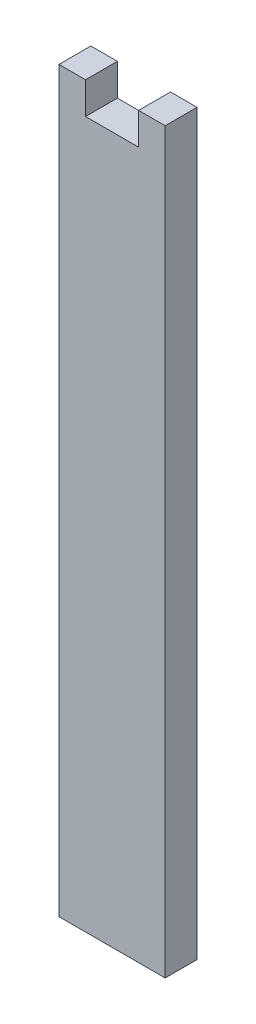
ISO-10303-21;
HEADER;
FILE_DESCRIPTION(('STEP AP214'),'2;1');
FILE_NAME('part.step','',(''),(''),'','','');
FILE_SCHEMA(('AUTOMOTIVE_DESIGN { 1 0 10303 214 1 1 1 1 }'));
ENDSEC;
DATA;
#1=APPLICATION_CONTEXT('core data for automotive mechanical design processes');
#2=APPLICATION_PROTOCOL_DEFINITION('international standard','automotive_design',2000,#1);
#3=PRODUCT_CONTEXT('',#1,'mechanical');
#4=PRODUCT('Part','Part','',(#3));
#5=PRODUCT_RELATED_PRODUCT_CATEGORY('part','',(#4));
#6=PRODUCT_DEFINITION_FORMATION('','',#4);
#7=PRODUCT_DEFINITION_CONTEXT('part definition',#1,'design');
#8=PRODUCT_DEFINITION('design','',#6,#7);
#9=PRODUCT_DEFINITION_SHAPE('','',#8);
#10=(LENGTH_UNIT() NAMED_UNIT(*) SI_UNIT(.MILLI.,.METRE.));
#11=(NAMED_UNIT(*) PLANE_ANGLE_UNIT() SI_UNIT($,.RADIAN.));
#12=(NAMED_UNIT(*) SI_UNIT($,.STERADIAN.) SOLID_ANGLE_UNIT());
#13=UNCERTAINTY_MEASURE_WITH_UNIT(LENGTH_MEASURE(1.E-05),#10,'distance_accuracy_value','');
#14=(GEOMETRIC_REPRESENTATION_CONTEXT(3) GLOBAL_UNCERTAINTY_ASSIGNED_CONTEXT((#13)) GLOBAL_UNIT_ASSIGNED_CONTEXT((#10,
#11,#12)) REPRESENTATION_CONTEXT('',''));
#15=CARTESIAN_POINT('',(0.,0.,0.));
#16=DIRECTION('',(0.,0.,1.));
#17=DIRECTION('',(1.,0.,0.));
#18=AXIS2_PLACEMENT_3D('',#15,#16,#17);
#19=CARTESIAN_POINT('',(0.,63.5,-6.));
#20=DIRECTION('',(0.,-1.,0.));
#21=DIRECTION('',(0.,0.,-1.));
#22=AXIS2_PLACEMENT_3D('',#19,#20,#21);
#23=PLANE('',#22);
#24=DIRECTION('',(1.,0.,0.));
#25=VECTOR('',#24,1.);
#26=CARTESIAN_POINT('',(0.,63.5,0.));
#27=LINE('',#26,#25);
#28=CARTESIAN_POINT('',(-5.,63.5,0.));
#29=VERTEX_POINT('',#28);
#30=CARTESIAN_POINT('',(5.,63.5,0.));
#31=VERTEX_POINT('',#30);
#32=EDGE_CURVE('E137',#29,#31,#27,.T.);
#33=ORIENTED_EDGE('',*,*,#32,.T.);
#34=DIRECTION('',(0.,0.,1.));
#35=VECTOR('',#34,1.);
#36=CARTESIAN_POINT('',(5.,63.5,-6.));
#37=LINE('',#36,#35);
#38=CARTESIAN_POINT('',(5.,63.5,-6.));
#39=VERTEX_POINT('',#38);
#40=EDGE_CURVE('E11',#39,#31,#37,.T.);
#41=ORIENTED_EDGE('',*,*,#40,.F.);
#42=DIRECTION('',(1.,0.,0.));
#43=VECTOR('',#42,1.);
#44=CARTESIAN_POINT('',(0.,63.5,-6.));
#45=LINE('',#44,#43);
#46=CARTESIAN_POINT('',(-5.,63.5,-6.));
#47=VERTEX_POINT('',#46);
#48=EDGE_CURVE('E59',#47,#39,#45,.T.);
#49=ORIENTED_EDGE('',*,*,#48,.F.);
#50=DIRECTION('',(0.,0.,1.));
#51=VECTOR('',#50,1.);
#52=CARTESIAN_POINT('',(-5.,63.5,-6.));
#53=LINE('',#52,#51);
#54=EDGE_CURVE('E44',#47,#29,#53,.T.);
#55=ORIENTED_EDGE('',*,*,#54,.T.);
#56=EDGE_LOOP('',(#33,#41,#49,#55));
#57=FACE_BOUND('',#56,.T.);
#58=ADVANCED_FACE('F41',(#57),#23,.F.);
#59=CARTESIAN_POINT('',(5.00000000000001,0.,-6.));
#60=DIRECTION('',(-1.,0.,0.));
#61=DIRECTION('',(0.,-1.,0.));
#62=AXIS2_PLACEMENT_3D('',#59,#60,#61);
#63=PLANE('',#62);
#64=DIRECTION('',(0.,-1.,0.));
#65=VECTOR('',#64,1.);
#66=CARTESIAN_POINT('',(5.00000000000001,0.,0.));
#67=LINE('',#66,#65);
#68=CARTESIAN_POINT('',(5.,69.5,0.));
#69=VERTEX_POINT('',#68);
#70=EDGE_CURVE('E151',#69,#31,#67,.T.);
#71=ORIENTED_EDGE('',*,*,#70,.F.);
#72=DIRECTION('',(0.,0.,1.));
#73=VECTOR('',#72,1.);
#74=CARTESIAN_POINT('',(5.,69.5,-6.));
#75=LINE('',#74,#73);
#76=CARTESIAN_POINT('',(5.,69.5,-6.));
#77=VERTEX_POINT('',#76);
#78=EDGE_CURVE('E50',#77,#69,#75,.T.);
#79=ORIENTED_EDGE('',*,*,#78,.F.);
#80=DIRECTION('',(0.,-1.,0.));
#81=VECTOR('',#80,1.);
#82=CARTESIAN_POINT('',(5.00000000000001,0.,-6.));
#83=LINE('',#82,#81);
#84=EDGE_CURVE('E119',#77,#39,#83,.T.);
#85=ORIENTED_EDGE('',*,*,#84,.T.);
#86=ORIENTED_EDGE('',*,*,#40,.T.);
#87=EDGE_LOOP('',(#71,#79,#85,#86));
#88=FACE_BOUND('',#87,.T.);
#89=ADVANCED_FACE('F171',(#88),#63,.T.);
#90=CARTESIAN_POINT('',(0.,69.5,-6.));
#91=DIRECTION('',(0.,-1.,0.));
#92=DIRECTION('',(0.,0.,-1.));
#93=AXIS2_PLACEMENT_3D('',#90,#91,#92);
#94=PLANE('',#93);
#95=DIRECTION('',(1.,0.,0.));
#96=VECTOR('',#95,1.);
#97=CARTESIAN_POINT('',(0.,69.5,0.));
#98=LINE('',#97,#96);
#99=CARTESIAN_POINT('',(10.,69.5,0.));
#100=VERTEX_POINT('',#99);
#101=EDGE_CURVE('E123',#69,#100,#98,.T.);
#102=ORIENTED_EDGE('',*,*,#101,.T.);
#103=DIRECTION('',(0.,0.,1.));
#104=VECTOR('',#103,1.);
#105=CARTESIAN_POINT('',(10.,69.5,-6.));
#106=LINE('',#105,#104);
#107=CARTESIAN_POINT('',(10.,69.5,-6.));
#108=VERTEX_POINT('',#107);
#109=EDGE_CURVE('E121',#108,#100,#106,.T.);
#110=ORIENTED_EDGE('',*,*,#109,.F.);
#111=DIRECTION('',(1.,0.,0.));
#112=VECTOR('',#111,1.);
#113=CARTESIAN_POINT('',(0.,69.5,-6.));
#114=LINE('',#113,#112);
#115=EDGE_CURVE('E112',#77,#108,#114,.T.);
#116=ORIENTED_EDGE('',*,*,#115,.F.);
#117=ORIENTED_EDGE('',*,*,#78,.T.);
#118=EDGE_LOOP('',(#102,#110,#116,#117));
#119=FACE_BOUND('',#118,.T.);
#120=ADVANCED_FACE('F122',(#119),#94,.F.);
#121=CARTESIAN_POINT('',(10.,0.,-6.));
#122=DIRECTION('',(1.,0.,0.));
#123=DIRECTION('',(0.,0.,-1.));
#124=AXIS2_PLACEMENT_3D('',#121,#122,#123);
#125=PLANE('',#124);
#126=DIRECTION('',(0.,1.,0.));
#127=VECTOR('',#126,1.);
#128=CARTESIAN_POINT('',(10.,0.,0.));
#129=LINE('',#128,#127);
#130=CARTESIAN_POINT('',(10.,-69.5,0.));
#131=VERTEX_POINT('',#130);
#132=EDGE_CURVE('E148',#131,#100,#129,.T.);
#133=ORIENTED_EDGE('',*,*,#132,.F.);
#134=DIRECTION('',(0.,0.,1.));
#135=VECTOR('',#134,1.);
#136=CARTESIAN_POINT('',(10.,-69.5,-6.));
#137=LINE('',#136,#135);
#138=CARTESIAN_POINT('',(10.,-69.5,-6.));
#139=VERTEX_POINT('',#138);
#140=EDGE_CURVE('E127',#139,#131,#137,.T.);
#141=ORIENTED_EDGE('',*,*,#140,.F.);
#142=DIRECTION('',(0.,1.,0.));
#143=VECTOR('',#142,1.);
#144=CARTESIAN_POINT('',(10.,0.,-6.));
#145=LINE('',#144,#143);
#146=EDGE_CURVE('E117',#139,#108,#145,.T.);
#147=ORIENTED_EDGE('',*,*,#146,.T.);
#148=ORIENTED_EDGE('',*,*,#109,.T.);
#149=EDGE_LOOP('',(#133,#141,#147,#148));
#150=FACE_BOUND('',#149,.T.);
#151=ADVANCED_FACE('F129',(#150),#125,.T.);
#152=CARTESIAN_POINT('',(0.,-69.5,-6.));
#153=DIRECTION('',(0.,-1.,0.));
#154=DIRECTION('',(0.,0.,-1.));
#155=AXIS2_PLACEMENT_3D('',#152,#153,#154);
#156=PLANE('',#155);
#157=DIRECTION('',(1.,0.,0.));
#158=VECTOR('',#157,1.);
#159=CARTESIAN_POINT('',(0.,-69.5,0.));
#160=LINE('',#159,#158);
#161=CARTESIAN_POINT('',(-10.,-69.5,0.));
#162=VERTEX_POINT('',#161);
#163=EDGE_CURVE('E145',#162,#131,#160,.T.);
#164=ORIENTED_EDGE('',*,*,#163,.F.);
#165=DIRECTION('',(0.,0.,1.));
#166=VECTOR('',#165,1.);
#167=CARTESIAN_POINT('',(-10.,-69.5,-6.));
#168=LINE('',#167,#166);
#169=CARTESIAN_POINT('',(-10.,-69.5,-6.));
#170=VERTEX_POINT('',#169);
#171=EDGE_CURVE('E156',#170,#162,#168,.T.);
#172=ORIENTED_EDGE('',*,*,#171,.F.);
#173=DIRECTION('',(1.,0.,0.));
#174=VECTOR('',#173,1.);
#175=CARTESIAN_POINT('',(0.,-69.5,-6.));
#176=LINE('',#175,#174);
#177=EDGE_CURVE('E130',#170,#139,#176,.T.);
#178=ORIENTED_EDGE('',*,*,#177,.T.);
#179=ORIENTED_EDGE('',*,*,#140,.T.);
#180=EDGE_LOOP('',(#164,#172,#178,#179));
#181=FACE_BOUND('',#180,.T.);
#182=ADVANCED_FACE('F184',(#181),#156,.T.);
#183=CARTESIAN_POINT('',(-10.,0.,-6.));
#184=DIRECTION('',(1.,0.,0.));
#185=DIRECTION('',(0.,0.,-1.));
#186=AXIS2_PLACEMENT_3D('',#183,#184,#185);
#187=PLANE('',#186);
#188=DIRECTION('',(0.,1.,0.));
#189=VECTOR('',#188,1.);
#190=CARTESIAN_POINT('',(-10.,0.,0.));
#191=LINE('',#190,#189);
#192=CARTESIAN_POINT('',(-10.,69.5,0.));
#193=VERTEX_POINT('',#192);
#194=EDGE_CURVE('E143',#162,#193,#191,.T.);
#195=ORIENTED_EDGE('',*,*,#194,.T.);
#196=DIRECTION('',(0.,0.,1.));
#197=VECTOR('',#196,1.);
#198=CARTESIAN_POINT('',(-10.,69.5,-6.));
#199=LINE('',#198,#197);
#200=CARTESIAN_POINT('',(-10.,69.5,-6.));
#201=VERTEX_POINT('',#200);
#202=EDGE_CURVE('E158',#201,#193,#199,.T.);
#203=ORIENTED_EDGE('',*,*,#202,.F.);
#204=DIRECTION('',(0.,1.,0.));
#205=VECTOR('',#204,1.);
#206=CARTESIAN_POINT('',(-10.,0.,-6.));
#207=LINE('',#206,#205);
#208=EDGE_CURVE('E132',#170,#201,#207,.T.);
#209=ORIENTED_EDGE('',*,*,#208,.F.);
#210=ORIENTED_EDGE('',*,*,#171,.T.);
#211=EDGE_LOOP('',(#195,#203,#209,#210));
#212=FACE_BOUND('',#211,.T.);
#213=ADVANCED_FACE('F187',(#212),#187,.F.);
#214=CARTESIAN_POINT('',(0.,69.5,-6.));
#215=DIRECTION('',(0.,-1.,0.));
#216=DIRECTION('',(0.,0.,-1.));
#217=AXIS2_PLACEMENT_3D('',#214,#215,#216);
#218=PLANE('',#217);
#219=DIRECTION('',(1.,0.,0.));
#220=VECTOR('',#219,1.);
#221=CARTESIAN_POINT('',(0.,69.5,0.));
#222=LINE('',#221,#220);
#223=CARTESIAN_POINT('',(-5.,69.5,0.));
#224=VERTEX_POINT('',#223);
#225=EDGE_CURVE('E141',#193,#224,#222,.T.);
#226=ORIENTED_EDGE('',*,*,#225,.T.);
#227=DIRECTION('',(0.,0.,1.));
#228=VECTOR('',#227,1.);
#229=CARTESIAN_POINT('',(-5.,69.5,-6.));
#230=LINE('',#229,#228);
#231=CARTESIAN_POINT('',(-5.,69.5,-6.));
#232=VERTEX_POINT('',#231);
#233=EDGE_CURVE('E160',#232,#224,#230,.T.);
#234=ORIENTED_EDGE('',*,*,#233,.F.);
#235=DIRECTION('',(1.,0.,0.));
#236=VECTOR('',#235,1.);
#237=CARTESIAN_POINT('',(0.,69.5,-6.));
#238=LINE('',#237,#236);
#239=EDGE_CURVE('E315',#201,#232,#238,.T.);
#240=ORIENTED_EDGE('',*,*,#239,.F.);
#241=ORIENTED_EDGE('',*,*,#202,.T.);
#242=EDGE_LOOP('',(#226,#234,#240,#241));
#243=FACE_BOUND('',#242,.T.);
#244=ADVANCED_FACE('F191',(#243),#218,.F.);
#245=CARTESIAN_POINT('',(-5.,0.,-6.));
#246=DIRECTION('',(-1.,0.,0.));
#247=DIRECTION('',(0.,0.,1.));
#248=AXIS2_PLACEMENT_3D('',#245,#246,#247);
#249=PLANE('',#248);
#250=DIRECTION('',(0.,-1.,0.));
#251=VECTOR('',#250,1.);
#252=CARTESIAN_POINT('',(-5.,0.,0.));
#253=LINE('',#252,#251);
#254=EDGE_CURVE('E139',#224,#29,#253,.T.);
#255=ORIENTED_EDGE('',*,*,#254,.T.);
#256=ORIENTED_EDGE('',*,*,#54,.F.);
#257=DIRECTION('',(0.,-1.,0.));
#258=VECTOR('',#257,1.);
#259=CARTESIAN_POINT('',(-5.,0.,-6.));
#260=LINE('',#259,#258);
#261=EDGE_CURVE('E98',#232,#47,#260,.T.);
#262=ORIENTED_EDGE('',*,*,#261,.F.);
#263=ORIENTED_EDGE('',*,*,#233,.T.);
#264=EDGE_LOOP('',(#255,#256,#262,#263));
#265=FACE_BOUND('',#264,.T.);
#266=ADVANCED_FACE('F194',(#265),#249,.F.);
#267=CARTESIAN_POINT('',(0.,0.,-6.));
#268=DIRECTION('',(0.,0.,1.));
#269=DIRECTION('',(1.,0.,0.));
#270=AXIS2_PLACEMENT_3D('',#267,#268,#269);
#271=PLANE('',#270);
#272=ORIENTED_EDGE('',*,*,#48,.T.);
#273=ORIENTED_EDGE('',*,*,#84,.F.);
#274=ORIENTED_EDGE('',*,*,#115,.T.);
#275=ORIENTED_EDGE('',*,*,#146,.F.);
#276=ORIENTED_EDGE('',*,*,#177,.F.);
#277=ORIENTED_EDGE('',*,*,#208,.T.);
#278=ORIENTED_EDGE('',*,*,#239,.T.);
#279=ORIENTED_EDGE('',*,*,#261,.T.);
#280=EDGE_LOOP('',(#272,#273,#274,#275,#276,#277,#278,#279));
#281=FACE_BOUND('',#280,.T.);
#282=ADVANCED_FACE('F114',(#281),#271,.F.);
#283=CARTESIAN_POINT('',(0.,0.,0.));
#284=DIRECTION('',(0.,0.,1.));
#285=DIRECTION('',(1.,0.,0.));
#286=AXIS2_PLACEMENT_3D('',#283,#284,#285);
#287=PLANE('',#286);
#288=ORIENTED_EDGE('',*,*,#32,.F.);
#289=ORIENTED_EDGE('',*,*,#254,.F.);
#290=ORIENTED_EDGE('',*,*,#225,.F.);
#291=ORIENTED_EDGE('',*,*,#194,.F.);
#292=ORIENTED_EDGE('',*,*,#163,.T.);
#293=ORIENTED_EDGE('',*,*,#132,.T.);
#294=ORIENTED_EDGE('',*,*,#101,.F.);
#295=ORIENTED_EDGE('',*,*,#70,.T.);
#296=EDGE_LOOP('',(#288,#289,#290,#291,#292,#293,#294,#295));
#297=FACE_BOUND('',#296,.T.);
#298=ADVANCED_FACE('F169',(#297),#287,.T.);
#299=CLOSED_SHELL('',(#58,#89,#120,#151,#182,#213,#244,#266,#282,#298));
#300=MANIFOLD_SOLID_BREP('B2',#299);
#301=ADVANCED_BREP_SHAPE_REPRESENTATION('',(#18,#300),#14);
#302=SHAPE_DEFINITION_REPRESENTATION(#9,#301);
ENDSEC;
END-ISO-10303-21;
